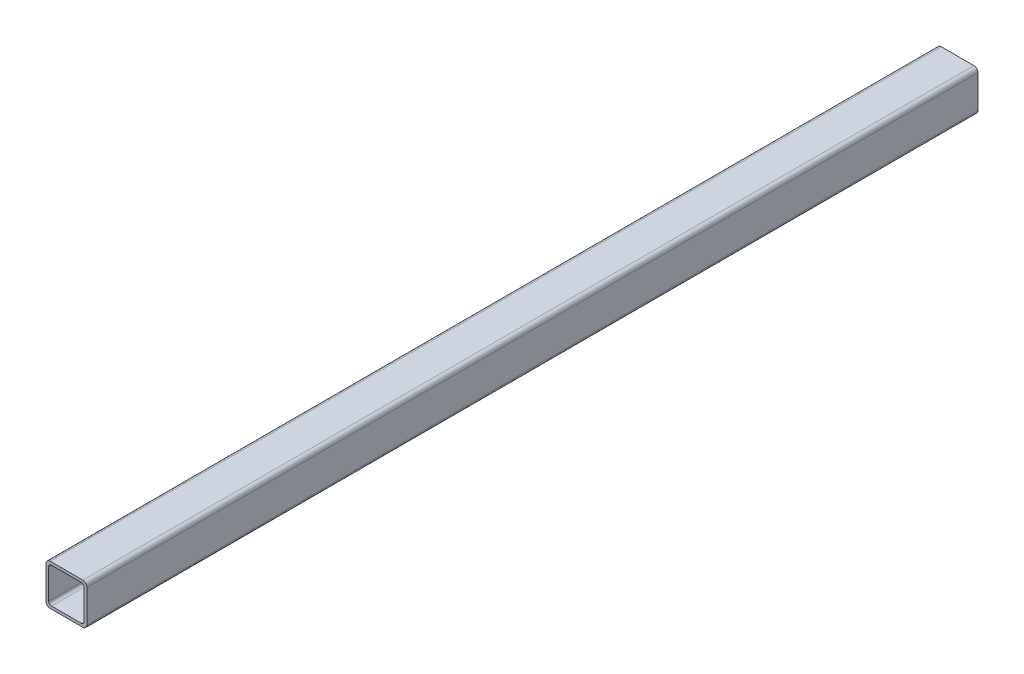
ISO-10303-21;
HEADER;
FILE_DESCRIPTION(('STEP AP214'),'2;1');
FILE_NAME('part.step','',(''),(''),'','','');
FILE_SCHEMA(('AUTOMOTIVE_DESIGN { 1 0 10303 214 1 1 1 1 }'));
ENDSEC;
DATA;
#1=APPLICATION_CONTEXT('core data for automotive mechanical design processes');
#2=APPLICATION_PROTOCOL_DEFINITION('international standard','automotive_design',2000,#1);
#3=PRODUCT_CONTEXT('',#1,'mechanical');
#4=PRODUCT('Part','Part','',(#3));
#5=PRODUCT_RELATED_PRODUCT_CATEGORY('part','',(#4));
#6=PRODUCT_DEFINITION_FORMATION('','',#4);
#7=PRODUCT_DEFINITION_CONTEXT('part definition',#1,'design');
#8=PRODUCT_DEFINITION('design','',#6,#7);
#9=PRODUCT_DEFINITION_SHAPE('','',#8);
#10=(LENGTH_UNIT() NAMED_UNIT(*) SI_UNIT(.MILLI.,.METRE.));
#11=(NAMED_UNIT(*) PLANE_ANGLE_UNIT() SI_UNIT($,.RADIAN.));
#12=(NAMED_UNIT(*) SI_UNIT($,.STERADIAN.) SOLID_ANGLE_UNIT());
#13=UNCERTAINTY_MEASURE_WITH_UNIT(LENGTH_MEASURE(1.E-05),#10,'distance_accuracy_value','');
#14=(GEOMETRIC_REPRESENTATION_CONTEXT(3) GLOBAL_UNCERTAINTY_ASSIGNED_CONTEXT((#13)) GLOBAL_UNIT_ASSIGNED_CONTEXT((#10,
#11,#12)) REPRESENTATION_CONTEXT('',''));
#15=CARTESIAN_POINT('',(0.,0.,0.));
#16=DIRECTION('',(0.,0.,1.));
#17=DIRECTION('',(1.,0.,0.));
#18=AXIS2_PLACEMENT_3D('',#15,#16,#17);
#19=CARTESIAN_POINT('',(-15.,27.,375.426406871193));
#20=DIRECTION('',(1.,0.,0.));
#21=DIRECTION('',(0.,0.,-1.));
#22=AXIS2_PLACEMENT_3D('',#19,#20,#21);
#23=PLANE('',#22);
#24=DIRECTION('',(0.,-1.,0.));
#25=VECTOR('',#24,1.);
#26=CARTESIAN_POINT('',(-15.,27.,327.));
#27=LINE('',#26,#25);
#28=CARTESIAN_POINT('',(-15.,27.,327.));
#29=VERTEX_POINT('',#28);
#30=CARTESIAN_POINT('',(-15.,3.,327.));
#31=VERTEX_POINT('',#30);
#32=EDGE_CURVE('E200',#29,#31,#27,.T.);
#33=ORIENTED_EDGE('',*,*,#32,.F.);
#34=DIRECTION('',(0.,0.,-1.));
#35=VECTOR('',#34,1.);
#36=CARTESIAN_POINT('',(-15.,27.,375.426406871193));
#37=LINE('',#36,#35);
#38=CARTESIAN_POINT('',(-15.,27.,-327.));
#39=VERTEX_POINT('',#38);
#40=EDGE_CURVE('E53',#29,#39,#37,.T.);
#41=ORIENTED_EDGE('',*,*,#40,.T.);
#42=DIRECTION('',(0.,-1.,0.));
#43=VECTOR('',#42,1.);
#44=CARTESIAN_POINT('',(-15.,27.,-327.));
#45=LINE('',#44,#43);
#46=CARTESIAN_POINT('',(-15.,3.,-327.));
#47=VERTEX_POINT('',#46);
#48=EDGE_CURVE('E276',#39,#47,#45,.T.);
#49=ORIENTED_EDGE('',*,*,#48,.T.);
#50=DIRECTION('',(0.,0.,-1.));
#51=VECTOR('',#50,1.);
#52=CARTESIAN_POINT('',(-15.,3.,375.426406871193));
#53=LINE('',#52,#51);
#54=EDGE_CURVE('E236',#31,#47,#53,.T.);
#55=ORIENTED_EDGE('',*,*,#54,.F.);
#56=EDGE_LOOP('',(#33,#41,#49,#55));
#57=FACE_BOUND('',#56,.T.);
#58=ADVANCED_FACE('F38',(#57),#23,.F.);
#59=CARTESIAN_POINT('',(-12.,27.,375.426406871193));
#60=DIRECTION('',(0.,0.,-1.));
#61=DIRECTION('',(-1.,0.,0.));
#62=AXIS2_PLACEMENT_3D('',#59,#60,#61);
#63=CYLINDRICAL_SURFACE('',#62,3.);
#64=CARTESIAN_POINT('',(-12.,27.,327.));
#65=DIRECTION('',(0.,0.,1.));
#66=DIRECTION('',(0.,-1.,0.));
#67=AXIS2_PLACEMENT_3D('',#64,#65,#66);
#68=CIRCLE('',#67,3.);
#69=CARTESIAN_POINT('',(-12.,30.,327.));
#70=VERTEX_POINT('',#69);
#71=EDGE_CURVE('E203',#70,#29,#68,.T.);
#72=ORIENTED_EDGE('',*,*,#71,.F.);
#73=DIRECTION('',(0.,0.,-1.));
#74=VECTOR('',#73,1.);
#75=CARTESIAN_POINT('',(-12.,30.,375.426406871193));
#76=LINE('',#75,#74);
#77=CARTESIAN_POINT('',(-12.,30.,-327.));
#78=VERTEX_POINT('',#77);
#79=EDGE_CURVE('E239',#70,#78,#76,.T.);
#80=ORIENTED_EDGE('',*,*,#79,.T.);
#81=CARTESIAN_POINT('',(-12.,27.,-327.));
#82=DIRECTION('',(0.,0.,1.));
#83=DIRECTION('',(0.,-1.,0.));
#84=AXIS2_PLACEMENT_3D('',#81,#82,#83);
#85=CIRCLE('',#84,3.);
#86=EDGE_CURVE('E274',#78,#39,#85,.T.);
#87=ORIENTED_EDGE('',*,*,#86,.T.);
#88=ORIENTED_EDGE('',*,*,#40,.F.);
#89=EDGE_LOOP('',(#72,#80,#87,#88));
#90=FACE_BOUND('',#89,.T.);
#91=ADVANCED_FACE('F324',(#90),#63,.T.);
#92=CARTESIAN_POINT('',(-12.,30.,375.426406871193));
#93=DIRECTION('',(0.,-1.,0.));
#94=DIRECTION('',(0.,0.,-1.));
#95=AXIS2_PLACEMENT_3D('',#92,#93,#94);
#96=PLANE('',#95);
#97=DIRECTION('',(-1.,0.,0.));
#98=VECTOR('',#97,1.);
#99=CARTESIAN_POINT('',(-12.,30.,327.));
#100=LINE('',#99,#98);
#101=CARTESIAN_POINT('',(12.,30.,327.));
#102=VERTEX_POINT('',#101);
#103=EDGE_CURVE('E206',#102,#70,#100,.T.);
#104=ORIENTED_EDGE('',*,*,#103,.F.);
#105=DIRECTION('',(0.,0.,-1.));
#106=VECTOR('',#105,1.);
#107=CARTESIAN_POINT('',(12.,30.,375.426406871193));
#108=LINE('',#107,#106);
#109=CARTESIAN_POINT('',(12.,30.,-327.));
#110=VERTEX_POINT('',#109);
#111=EDGE_CURVE('E241',#102,#110,#108,.T.);
#112=ORIENTED_EDGE('',*,*,#111,.T.);
#113=DIRECTION('',(-1.,0.,0.));
#114=VECTOR('',#113,1.);
#115=CARTESIAN_POINT('',(-12.,30.,-327.));
#116=LINE('',#115,#114);
#117=EDGE_CURVE('E271',#110,#78,#116,.T.);
#118=ORIENTED_EDGE('',*,*,#117,.T.);
#119=ORIENTED_EDGE('',*,*,#79,.F.);
#120=EDGE_LOOP('',(#104,#112,#118,#119));
#121=FACE_BOUND('',#120,.T.);
#122=ADVANCED_FACE('F329',(#121),#96,.F.);
#123=CARTESIAN_POINT('',(12.,27.,375.426406871193));
#124=DIRECTION('',(0.,0.,-1.));
#125=DIRECTION('',(-1.,0.,0.));
#126=AXIS2_PLACEMENT_3D('',#123,#124,#125);
#127=CYLINDRICAL_SURFACE('',#126,3.);
#128=CARTESIAN_POINT('',(12.,27.,327.));
#129=DIRECTION('',(0.,0.,1.));
#130=DIRECTION('',(0.,-1.,0.));
#131=AXIS2_PLACEMENT_3D('',#128,#129,#130);
#132=CIRCLE('',#131,3.);
#133=CARTESIAN_POINT('',(15.,27.,327.));
#134=VERTEX_POINT('',#133);
#135=EDGE_CURVE('E209',#134,#102,#132,.T.);
#136=ORIENTED_EDGE('',*,*,#135,.F.);
#137=DIRECTION('',(0.,0.,-1.));
#138=VECTOR('',#137,1.);
#139=CARTESIAN_POINT('',(15.,27.,375.426406871193));
#140=LINE('',#139,#138);
#141=CARTESIAN_POINT('',(15.,27.,-327.));
#142=VERTEX_POINT('',#141);
#143=EDGE_CURVE('E243',#134,#142,#140,.T.);
#144=ORIENTED_EDGE('',*,*,#143,.T.);
#145=CARTESIAN_POINT('',(12.,27.,-327.));
#146=DIRECTION('',(0.,0.,1.));
#147=DIRECTION('',(0.,-1.,0.));
#148=AXIS2_PLACEMENT_3D('',#145,#146,#147);
#149=CIRCLE('',#148,3.);
#150=EDGE_CURVE('E268',#142,#110,#149,.T.);
#151=ORIENTED_EDGE('',*,*,#150,.T.);
#152=ORIENTED_EDGE('',*,*,#111,.F.);
#153=EDGE_LOOP('',(#136,#144,#151,#152));
#154=FACE_BOUND('',#153,.T.);
#155=ADVANCED_FACE('F334',(#154),#127,.T.);
#156=CARTESIAN_POINT('',(15.,27.,375.426406871193));
#157=DIRECTION('',(-1.,0.,0.));
#158=DIRECTION('',(0.,-1.,0.));
#159=AXIS2_PLACEMENT_3D('',#156,#157,#158);
#160=PLANE('',#159);
#161=DIRECTION('',(0.,1.,0.));
#162=VECTOR('',#161,1.);
#163=CARTESIAN_POINT('',(15.,27.,327.));
#164=LINE('',#163,#162);
#165=CARTESIAN_POINT('',(15.,3.,327.));
#166=VERTEX_POINT('',#165);
#167=EDGE_CURVE('E212',#166,#134,#164,.T.);
#168=ORIENTED_EDGE('',*,*,#167,.F.);
#169=DIRECTION('',(0.,0.,-1.));
#170=VECTOR('',#169,1.);
#171=CARTESIAN_POINT('',(15.,3.,375.426406871193));
#172=LINE('',#171,#170);
#173=CARTESIAN_POINT('',(15.,3.,-327.));
#174=VERTEX_POINT('',#173);
#175=EDGE_CURVE('E245',#166,#174,#172,.T.);
#176=ORIENTED_EDGE('',*,*,#175,.T.);
#177=DIRECTION('',(0.,1.,0.));
#178=VECTOR('',#177,1.);
#179=CARTESIAN_POINT('',(15.,27.,-327.));
#180=LINE('',#179,#178);
#181=EDGE_CURVE('E263',#174,#142,#180,.T.);
#182=ORIENTED_EDGE('',*,*,#181,.T.);
#183=ORIENTED_EDGE('',*,*,#143,.F.);
#184=EDGE_LOOP('',(#168,#176,#182,#183));
#185=FACE_BOUND('',#184,.T.);
#186=ADVANCED_FACE('F338',(#185),#160,.F.);
#187=CARTESIAN_POINT('',(12.,3.,375.426406871193));
#188=DIRECTION('',(0.,0.,-1.));
#189=DIRECTION('',(-1.,0.,0.));
#190=AXIS2_PLACEMENT_3D('',#187,#188,#189);
#191=CYLINDRICAL_SURFACE('',#190,3.);
#192=CARTESIAN_POINT('',(12.,3.,327.));
#193=DIRECTION('',(0.,0.,1.));
#194=DIRECTION('',(0.,-1.,0.));
#195=AXIS2_PLACEMENT_3D('',#192,#193,#194);
#196=CIRCLE('',#195,3.);
#197=CARTESIAN_POINT('',(12.,0.,327.));
#198=VERTEX_POINT('',#197);
#199=EDGE_CURVE('E215',#198,#166,#196,.T.);
#200=ORIENTED_EDGE('',*,*,#199,.F.);
#201=DIRECTION('',(0.,0.,-1.));
#202=VECTOR('',#201,1.);
#203=CARTESIAN_POINT('',(12.,0.,375.426406871193));
#204=LINE('',#203,#202);
#205=CARTESIAN_POINT('',(12.,0.,-327.));
#206=VERTEX_POINT('',#205);
#207=EDGE_CURVE('E247',#198,#206,#204,.T.);
#208=ORIENTED_EDGE('',*,*,#207,.T.);
#209=CARTESIAN_POINT('',(12.,3.,-327.));
#210=DIRECTION('',(0.,0.,1.));
#211=DIRECTION('',(0.,-1.,0.));
#212=AXIS2_PLACEMENT_3D('',#209,#210,#211);
#213=CIRCLE('',#212,3.);
#214=EDGE_CURVE('E262',#206,#174,#213,.T.);
#215=ORIENTED_EDGE('',*,*,#214,.T.);
#216=ORIENTED_EDGE('',*,*,#175,.F.);
#217=EDGE_LOOP('',(#200,#208,#215,#216));
#218=FACE_BOUND('',#217,.T.);
#219=ADVANCED_FACE('F342',(#218),#191,.T.);
#220=CARTESIAN_POINT('',(-12.,0.,375.426406871193));
#221=DIRECTION('',(0.,1.,0.));
#222=DIRECTION('',(-1.,0.,0.));
#223=AXIS2_PLACEMENT_3D('',#220,#221,#222);
#224=PLANE('',#223);
#225=DIRECTION('',(1.,0.,0.));
#226=VECTOR('',#225,1.);
#227=CARTESIAN_POINT('',(-12.,0.,327.));
#228=LINE('',#227,#226);
#229=CARTESIAN_POINT('',(-12.,0.,327.));
#230=VERTEX_POINT('',#229);
#231=EDGE_CURVE('E218',#230,#198,#228,.T.);
#232=ORIENTED_EDGE('',*,*,#231,.F.);
#233=DIRECTION('',(0.,0.,-1.));
#234=VECTOR('',#233,1.);
#235=CARTESIAN_POINT('',(-12.,0.,375.426406871193));
#236=LINE('',#235,#234);
#237=CARTESIAN_POINT('',(-12.,0.,-327.));
#238=VERTEX_POINT('',#237);
#239=EDGE_CURVE('E46',#230,#238,#236,.T.);
#240=ORIENTED_EDGE('',*,*,#239,.T.);
#241=DIRECTION('',(1.,0.,0.));
#242=VECTOR('',#241,1.);
#243=CARTESIAN_POINT('',(-12.,0.,-327.));
#244=LINE('',#243,#242);
#245=EDGE_CURVE('E181',#238,#206,#244,.T.);
#246=ORIENTED_EDGE('',*,*,#245,.T.);
#247=ORIENTED_EDGE('',*,*,#207,.F.);
#248=EDGE_LOOP('',(#232,#240,#246,#247));
#249=FACE_BOUND('',#248,.T.);
#250=ADVANCED_FACE('F251',(#249),#224,.F.);
#251=CARTESIAN_POINT('',(-12.,3.,375.426406871193));
#252=DIRECTION('',(0.,0.,-1.));
#253=DIRECTION('',(-1.,0.,0.));
#254=AXIS2_PLACEMENT_3D('',#251,#252,#253);
#255=CYLINDRICAL_SURFACE('',#254,3.);
#256=CARTESIAN_POINT('',(-12.,3.,327.));
#257=DIRECTION('',(0.,0.,1.));
#258=DIRECTION('',(0.,-1.,0.));
#259=AXIS2_PLACEMENT_3D('',#256,#257,#258);
#260=CIRCLE('',#259,3.);
#261=EDGE_CURVE('E221',#31,#230,#260,.T.);
#262=ORIENTED_EDGE('',*,*,#261,.F.);
#263=ORIENTED_EDGE('',*,*,#54,.T.);
#264=CARTESIAN_POINT('',(-12.,3.,-327.));
#265=DIRECTION('',(0.,0.,1.));
#266=DIRECTION('',(0.,-1.,0.));
#267=AXIS2_PLACEMENT_3D('',#264,#265,#266);
#268=CIRCLE('',#267,3.);
#269=EDGE_CURVE('E176',#47,#238,#268,.T.);
#270=ORIENTED_EDGE('',*,*,#269,.T.);
#271=ORIENTED_EDGE('',*,*,#239,.F.);
#272=EDGE_LOOP('',(#262,#263,#270,#271));
#273=FACE_BOUND('',#272,.T.);
#274=ADVANCED_FACE('F40',(#273),#255,.T.);
#275=CARTESIAN_POINT('',(-13.,26.,375.426406871193));
#276=DIRECTION('',(1.,0.,0.));
#277=DIRECTION('',(0.,0.,-1.));
#278=AXIS2_PLACEMENT_3D('',#275,#276,#277);
#279=PLANE('',#278);
#280=DIRECTION('',(0.,0.,-1.));
#281=VECTOR('',#280,1.);
#282=CARTESIAN_POINT('',(-13.,26.,375.426406871193));
#283=LINE('',#282,#281);
#284=CARTESIAN_POINT('',(-13.,26.,327.));
#285=VERTEX_POINT('',#284);
#286=CARTESIAN_POINT('',(-13.,26.,-327.));
#287=VERTEX_POINT('',#286);
#288=EDGE_CURVE('E152',#285,#287,#283,.T.);
#289=ORIENTED_EDGE('',*,*,#288,.F.);
#290=DIRECTION('',(0.,-1.,0.));
#291=VECTOR('',#290,1.);
#292=CARTESIAN_POINT('',(-13.,26.,327.));
#293=LINE('',#292,#291);
#294=CARTESIAN_POINT('',(-13.,4.00000000000001,327.));
#295=VERTEX_POINT('',#294);
#296=EDGE_CURVE('E12',#285,#295,#293,.T.);
#297=ORIENTED_EDGE('',*,*,#296,.T.);
#298=DIRECTION('',(0.,0.,-1.));
#299=VECTOR('',#298,1.);
#300=CARTESIAN_POINT('',(-13.,4.00000000000001,375.426406871193));
#301=LINE('',#300,#299);
#302=CARTESIAN_POINT('',(-13.,4.00000000000001,-327.));
#303=VERTEX_POINT('',#302);
#304=EDGE_CURVE('E161',#295,#303,#301,.T.);
#305=ORIENTED_EDGE('',*,*,#304,.T.);
#306=DIRECTION('',(0.,-1.,0.));
#307=VECTOR('',#306,1.);
#308=CARTESIAN_POINT('',(-13.,26.,-327.));
#309=LINE('',#308,#307);
#310=EDGE_CURVE('E169',#287,#303,#309,.T.);
#311=ORIENTED_EDGE('',*,*,#310,.F.);
#312=EDGE_LOOP('',(#289,#297,#305,#311));
#313=FACE_BOUND('',#312,.T.);
#314=ADVANCED_FACE('F174',(#313),#279,.T.);
#315=CARTESIAN_POINT('',(-11.,26.,375.426406871193));
#316=DIRECTION('',(0.,0.,-1.));
#317=DIRECTION('',(-1.,0.,0.));
#318=AXIS2_PLACEMENT_3D('',#315,#316,#317);
#319=CYLINDRICAL_SURFACE('',#318,2.);
#320=DIRECTION('',(0.,0.,-1.));
#321=VECTOR('',#320,1.);
#322=CARTESIAN_POINT('',(-11.,28.,375.426406871193));
#323=LINE('',#322,#321);
#324=CARTESIAN_POINT('',(-11.,28.,327.));
#325=VERTEX_POINT('',#324);
#326=CARTESIAN_POINT('',(-11.,28.,-327.));
#327=VERTEX_POINT('',#326);
#328=EDGE_CURVE('E160',#325,#327,#323,.T.);
#329=ORIENTED_EDGE('',*,*,#328,.F.);
#330=CARTESIAN_POINT('',(-11.,26.,327.));
#331=DIRECTION('',(0.,0.,1.));
#332=DIRECTION('',(0.,-1.,0.));
#333=AXIS2_PLACEMENT_3D('',#330,#331,#332);
#334=CIRCLE('',#333,2.);
#335=EDGE_CURVE('E157',#325,#285,#334,.T.);
#336=ORIENTED_EDGE('',*,*,#335,.T.);
#337=ORIENTED_EDGE('',*,*,#288,.T.);
#338=CARTESIAN_POINT('',(-11.,26.,-327.));
#339=DIRECTION('',(0.,0.,1.));
#340=DIRECTION('',(0.,-1.,0.));
#341=AXIS2_PLACEMENT_3D('',#338,#339,#340);
#342=CIRCLE('',#341,2.);
#343=EDGE_CURVE('E156',#327,#287,#342,.T.);
#344=ORIENTED_EDGE('',*,*,#343,.F.);
#345=EDGE_LOOP('',(#329,#336,#337,#344));
#346=FACE_BOUND('',#345,.T.);
#347=ADVANCED_FACE('F155',(#346),#319,.F.);
#348=CARTESIAN_POINT('',(-11.,28.,375.426406871193));
#349=DIRECTION('',(0.,-1.,0.));
#350=DIRECTION('',(0.,0.,-1.));
#351=AXIS2_PLACEMENT_3D('',#348,#349,#350);
#352=PLANE('',#351);
#353=DIRECTION('',(0.,0.,-1.));
#354=VECTOR('',#353,1.);
#355=CARTESIAN_POINT('',(11.,28.,375.426406871193));
#356=LINE('',#355,#354);
#357=CARTESIAN_POINT('',(11.,28.,327.));
#358=VERTEX_POINT('',#357);
#359=CARTESIAN_POINT('',(11.,28.,-327.));
#360=VERTEX_POINT('',#359);
#361=EDGE_CURVE('E226',#358,#360,#356,.T.);
#362=ORIENTED_EDGE('',*,*,#361,.F.);
#363=DIRECTION('',(-1.,0.,0.));
#364=VECTOR('',#363,1.);
#365=CARTESIAN_POINT('',(-11.,28.,327.));
#366=LINE('',#365,#364);
#367=EDGE_CURVE('E178',#358,#325,#366,.T.);
#368=ORIENTED_EDGE('',*,*,#367,.T.);
#369=ORIENTED_EDGE('',*,*,#328,.T.);
#370=DIRECTION('',(-1.,0.,0.));
#371=VECTOR('',#370,1.);
#372=CARTESIAN_POINT('',(-11.,28.,-327.));
#373=LINE('',#372,#371);
#374=EDGE_CURVE('E172',#360,#327,#373,.T.);
#375=ORIENTED_EDGE('',*,*,#374,.F.);
#376=EDGE_LOOP('',(#362,#368,#369,#375));
#377=FACE_BOUND('',#376,.T.);
#378=ADVANCED_FACE('F297',(#377),#352,.T.);
#379=CARTESIAN_POINT('',(11.,26.,375.426406871193));
#380=DIRECTION('',(0.,0.,-1.));
#381=DIRECTION('',(-1.,0.,0.));
#382=AXIS2_PLACEMENT_3D('',#379,#380,#381);
#383=CYLINDRICAL_SURFACE('',#382,2.);
#384=DIRECTION('',(0.,0.,-1.));
#385=VECTOR('',#384,1.);
#386=CARTESIAN_POINT('',(13.,26.,375.426406871193));
#387=LINE('',#386,#385);
#388=CARTESIAN_POINT('',(13.,26.,327.));
#389=VERTEX_POINT('',#388);
#390=CARTESIAN_POINT('',(13.,26.,-327.));
#391=VERTEX_POINT('',#390);
#392=EDGE_CURVE('E228',#389,#391,#387,.T.);
#393=ORIENTED_EDGE('',*,*,#392,.F.);
#394=CARTESIAN_POINT('',(11.,26.,327.));
#395=DIRECTION('',(0.,0.,1.));
#396=DIRECTION('',(0.,-1.,0.));
#397=AXIS2_PLACEMENT_3D('',#394,#395,#396);
#398=CIRCLE('',#397,2.);
#399=EDGE_CURVE('E187',#389,#358,#398,.T.);
#400=ORIENTED_EDGE('',*,*,#399,.T.);
#401=ORIENTED_EDGE('',*,*,#361,.T.);
#402=CARTESIAN_POINT('',(11.,26.,-327.));
#403=DIRECTION('',(0.,0.,1.));
#404=DIRECTION('',(0.,-1.,0.));
#405=AXIS2_PLACEMENT_3D('',#402,#403,#404);
#406=CIRCLE('',#405,2.);
#407=EDGE_CURVE('E289',#391,#360,#406,.T.);
#408=ORIENTED_EDGE('',*,*,#407,.F.);
#409=EDGE_LOOP('',(#393,#400,#401,#408));
#410=FACE_BOUND('',#409,.T.);
#411=ADVANCED_FACE('F301',(#410),#383,.F.);
#412=CARTESIAN_POINT('',(13.,26.,375.426406871193));
#413=DIRECTION('',(-1.,0.,0.));
#414=DIRECTION('',(0.,0.,1.));
#415=AXIS2_PLACEMENT_3D('',#412,#413,#414);
#416=PLANE('',#415);
#417=DIRECTION('',(0.,0.,-1.));
#418=VECTOR('',#417,1.);
#419=CARTESIAN_POINT('',(13.,4.00000000000001,375.426406871193));
#420=LINE('',#419,#418);
#421=CARTESIAN_POINT('',(13.,4.00000000000002,327.));
#422=VERTEX_POINT('',#421);
#423=CARTESIAN_POINT('',(13.,4.00000000000002,-327.));
#424=VERTEX_POINT('',#423);
#425=EDGE_CURVE('E230',#422,#424,#420,.T.);
#426=ORIENTED_EDGE('',*,*,#425,.F.);
#427=DIRECTION('',(0.,1.,0.));
#428=VECTOR('',#427,1.);
#429=CARTESIAN_POINT('',(13.,26.,327.));
#430=LINE('',#429,#428);
#431=EDGE_CURVE('E190',#422,#389,#430,.T.);
#432=ORIENTED_EDGE('',*,*,#431,.T.);
#433=ORIENTED_EDGE('',*,*,#392,.T.);
#434=DIRECTION('',(0.,1.,0.));
#435=VECTOR('',#434,1.);
#436=CARTESIAN_POINT('',(13.,26.,-327.));
#437=LINE('',#436,#435);
#438=EDGE_CURVE('E286',#424,#391,#437,.T.);
#439=ORIENTED_EDGE('',*,*,#438,.F.);
#440=EDGE_LOOP('',(#426,#432,#433,#439));
#441=FACE_BOUND('',#440,.T.);
#442=ADVANCED_FACE('F303',(#441),#416,.T.);
#443=CARTESIAN_POINT('',(11.,4.,375.426406871193));
#444=DIRECTION('',(0.,0.,-1.));
#445=DIRECTION('',(-1.,0.,0.));
#446=AXIS2_PLACEMENT_3D('',#443,#444,#445);
#447=CYLINDRICAL_SURFACE('',#446,2.);
#448=DIRECTION('',(0.,0.,-1.));
#449=VECTOR('',#448,1.);
#450=CARTESIAN_POINT('',(11.,2.,375.426406871193));
#451=LINE('',#450,#449);
#452=CARTESIAN_POINT('',(11.,2.,327.));
#453=VERTEX_POINT('',#452);
#454=CARTESIAN_POINT('',(11.,2.,-327.));
#455=VERTEX_POINT('',#454);
#456=EDGE_CURVE('E232',#453,#455,#451,.T.);
#457=ORIENTED_EDGE('',*,*,#456,.F.);
#458=CARTESIAN_POINT('',(11.,4.,327.));
#459=DIRECTION('',(0.,0.,1.));
#460=DIRECTION('',(0.,-1.,0.));
#461=AXIS2_PLACEMENT_3D('',#458,#459,#460);
#462=CIRCLE('',#461,2.);
#463=EDGE_CURVE('E193',#453,#422,#462,.T.);
#464=ORIENTED_EDGE('',*,*,#463,.T.);
#465=ORIENTED_EDGE('',*,*,#425,.T.);
#466=CARTESIAN_POINT('',(11.,4.,-327.));
#467=DIRECTION('',(0.,0.,1.));
#468=DIRECTION('',(0.,-1.,0.));
#469=AXIS2_PLACEMENT_3D('',#466,#467,#468);
#470=CIRCLE('',#469,2.);
#471=EDGE_CURVE('E283',#455,#424,#470,.T.);
#472=ORIENTED_EDGE('',*,*,#471,.F.);
#473=EDGE_LOOP('',(#457,#464,#465,#472));
#474=FACE_BOUND('',#473,.T.);
#475=ADVANCED_FACE('F307',(#474),#447,.F.);
#476=CARTESIAN_POINT('',(-11.,2.,375.426406871193));
#477=DIRECTION('',(0.,1.,0.));
#478=DIRECTION('',(0.,0.,1.));
#479=AXIS2_PLACEMENT_3D('',#476,#477,#478);
#480=PLANE('',#479);
#481=DIRECTION('',(0.,0.,-1.));
#482=VECTOR('',#481,1.);
#483=CARTESIAN_POINT('',(-11.,2.,375.426406871193));
#484=LINE('',#483,#482);
#485=CARTESIAN_POINT('',(-11.,2.,327.));
#486=VERTEX_POINT('',#485);
#487=CARTESIAN_POINT('',(-11.,2.,-327.));
#488=VERTEX_POINT('',#487);
#489=EDGE_CURVE('E234',#486,#488,#484,.T.);
#490=ORIENTED_EDGE('',*,*,#489,.F.);
#491=DIRECTION('',(1.,0.,0.));
#492=VECTOR('',#491,1.);
#493=CARTESIAN_POINT('',(-11.,2.,327.));
#494=LINE('',#493,#492);
#495=EDGE_CURVE('E196',#486,#453,#494,.T.);
#496=ORIENTED_EDGE('',*,*,#495,.T.);
#497=ORIENTED_EDGE('',*,*,#456,.T.);
#498=DIRECTION('',(1.,0.,0.));
#499=VECTOR('',#498,1.);
#500=CARTESIAN_POINT('',(-11.,2.,-327.));
#501=LINE('',#500,#499);
#502=EDGE_CURVE('E280',#488,#455,#501,.T.);
#503=ORIENTED_EDGE('',*,*,#502,.F.);
#504=EDGE_LOOP('',(#490,#496,#497,#503));
#505=FACE_BOUND('',#504,.T.);
#506=ADVANCED_FACE('F311',(#505),#480,.T.);
#507=CARTESIAN_POINT('',(-11.,4.,375.426406871193));
#508=DIRECTION('',(0.,0.,-1.));
#509=DIRECTION('',(-1.,0.,0.));
#510=AXIS2_PLACEMENT_3D('',#507,#508,#509);
#511=CYLINDRICAL_SURFACE('',#510,2.);
#512=ORIENTED_EDGE('',*,*,#304,.F.);
#513=CARTESIAN_POINT('',(-11.,4.,327.));
#514=DIRECTION('',(0.,0.,1.));
#515=DIRECTION('',(0.,-1.,0.));
#516=AXIS2_PLACEMENT_3D('',#513,#514,#515);
#517=CIRCLE('',#516,2.);
#518=EDGE_CURVE('E61',#295,#486,#517,.T.);
#519=ORIENTED_EDGE('',*,*,#518,.T.);
#520=ORIENTED_EDGE('',*,*,#489,.T.);
#521=CARTESIAN_POINT('',(-11.,4.,-327.));
#522=DIRECTION('',(0.,0.,1.));
#523=DIRECTION('',(0.,-1.,0.));
#524=AXIS2_PLACEMENT_3D('',#521,#522,#523);
#525=CIRCLE('',#524,2.);
#526=EDGE_CURVE('E278',#303,#488,#525,.T.);
#527=ORIENTED_EDGE('',*,*,#526,.F.);
#528=EDGE_LOOP('',(#512,#519,#520,#527));
#529=FACE_BOUND('',#528,.T.);
#530=ADVANCED_FACE('F313',(#529),#511,.F.);
#531=CARTESIAN_POINT('',(0.,-105.5,327.));
#532=DIRECTION('',(0.,0.,1.));
#533=DIRECTION('',(1.,0.,0.));
#534=AXIS2_PLACEMENT_3D('',#531,#532,#533);
#535=PLANE('',#534);
#536=ORIENTED_EDGE('',*,*,#518,.F.);
#537=ORIENTED_EDGE('',*,*,#296,.F.);
#538=ORIENTED_EDGE('',*,*,#335,.F.);
#539=ORIENTED_EDGE('',*,*,#367,.F.);
#540=ORIENTED_EDGE('',*,*,#399,.F.);
#541=ORIENTED_EDGE('',*,*,#431,.F.);
#542=ORIENTED_EDGE('',*,*,#463,.F.);
#543=ORIENTED_EDGE('',*,*,#495,.F.);
#544=EDGE_LOOP('',(#536,#537,#538,#539,#540,#541,#542,#543));
#545=FACE_BOUND('',#544,.T.);
#546=ORIENTED_EDGE('',*,*,#32,.T.);
#547=ORIENTED_EDGE('',*,*,#261,.T.);
#548=ORIENTED_EDGE('',*,*,#231,.T.);
#549=ORIENTED_EDGE('',*,*,#199,.T.);
#550=ORIENTED_EDGE('',*,*,#167,.T.);
#551=ORIENTED_EDGE('',*,*,#135,.T.);
#552=ORIENTED_EDGE('',*,*,#103,.T.);
#553=ORIENTED_EDGE('',*,*,#71,.T.);
#554=EDGE_LOOP('',(#546,#547,#548,#549,#550,#551,#552,#553));
#555=FACE_BOUND('',#554,.T.);
#556=ADVANCED_FACE('F298',(#545,#555),#535,.T.);
#557=CARTESIAN_POINT('',(0.,-105.5,-327.));
#558=DIRECTION('',(0.,0.,-1.));
#559=DIRECTION('',(1.,0.,0.));
#560=AXIS2_PLACEMENT_3D('',#557,#558,#559);
#561=PLANE('',#560);
#562=ORIENTED_EDGE('',*,*,#526,.T.);
#563=ORIENTED_EDGE('',*,*,#502,.T.);
#564=ORIENTED_EDGE('',*,*,#471,.T.);
#565=ORIENTED_EDGE('',*,*,#438,.T.);
#566=ORIENTED_EDGE('',*,*,#407,.T.);
#567=ORIENTED_EDGE('',*,*,#374,.T.);
#568=ORIENTED_EDGE('',*,*,#343,.T.);
#569=ORIENTED_EDGE('',*,*,#310,.T.);
#570=EDGE_LOOP('',(#562,#563,#564,#565,#566,#567,#568,#569));
#571=FACE_BOUND('',#570,.T.);
#572=ORIENTED_EDGE('',*,*,#48,.F.);
#573=ORIENTED_EDGE('',*,*,#86,.F.);
#574=ORIENTED_EDGE('',*,*,#117,.F.);
#575=ORIENTED_EDGE('',*,*,#150,.F.);
#576=ORIENTED_EDGE('',*,*,#181,.F.);
#577=ORIENTED_EDGE('',*,*,#214,.F.);
#578=ORIENTED_EDGE('',*,*,#245,.F.);
#579=ORIENTED_EDGE('',*,*,#269,.F.);
#580=EDGE_LOOP('',(#572,#573,#574,#575,#576,#577,#578,#579));
#581=FACE_BOUND('',#580,.T.);
#582=ADVANCED_FACE('F167',(#571,#581),#561,.T.);
#583=CLOSED_SHELL('',(#58,#91,#122,#155,#186,#219,#250,#274,#314,#347,#378,#411,#442,#475,#506,
#530,#556,#582));
#584=MANIFOLD_SOLID_BREP('B2',#583);
#585=ADVANCED_BREP_SHAPE_REPRESENTATION('',(#18,#584),#14);
#586=SHAPE_DEFINITION_REPRESENTATION(#9,#585);
ENDSEC;
END-ISO-10303-21;
